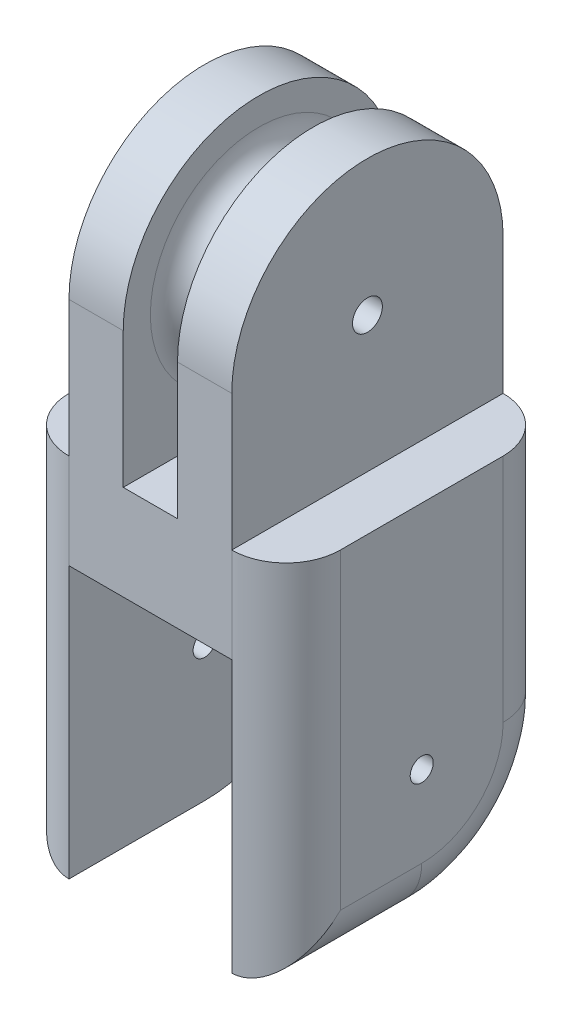
ISO-10303-21;
HEADER;
FILE_DESCRIPTION(('STEP AP214'),'2;1');
FILE_NAME('part.step','',(''),(''),'','','');
FILE_SCHEMA(('AUTOMOTIVE_DESIGN { 1 0 10303 214 1 1 1 1 }'));
ENDSEC;
DATA;
#1=APPLICATION_CONTEXT('core data for automotive mechanical design processes');
#2=APPLICATION_PROTOCOL_DEFINITION('international standard','automotive_design',2000,#1);
#3=PRODUCT_CONTEXT('',#1,'mechanical');
#4=PRODUCT('Part','Part','',(#3));
#5=PRODUCT_RELATED_PRODUCT_CATEGORY('part','',(#4));
#6=PRODUCT_DEFINITION_FORMATION('','',#4);
#7=PRODUCT_DEFINITION_CONTEXT('part definition',#1,'design');
#8=PRODUCT_DEFINITION('design','',#6,#7);
#9=PRODUCT_DEFINITION_SHAPE('','',#8);
#10=(LENGTH_UNIT() NAMED_UNIT(*) SI_UNIT(.MILLI.,.METRE.));
#11=(NAMED_UNIT(*) PLANE_ANGLE_UNIT() SI_UNIT($,.RADIAN.));
#12=(NAMED_UNIT(*) SI_UNIT($,.STERADIAN.) SOLID_ANGLE_UNIT());
#13=UNCERTAINTY_MEASURE_WITH_UNIT(LENGTH_MEASURE(1.E-05),#10,'distance_accuracy_value','');
#14=(GEOMETRIC_REPRESENTATION_CONTEXT(3) GLOBAL_UNCERTAINTY_ASSIGNED_CONTEXT((#13)) GLOBAL_UNIT_ASSIGNED_CONTEXT((#10,
#11,#12)) REPRESENTATION_CONTEXT('',''));
#15=CARTESIAN_POINT('',(0.,0.,0.));
#16=DIRECTION('',(0.,0.,1.));
#17=DIRECTION('',(1.,0.,0.));
#18=AXIS2_PLACEMENT_3D('',#15,#16,#17);
#19=CARTESIAN_POINT('',(0.,7.,0.));
#20=DIRECTION('',(0.,1.,0.));
#21=DIRECTION('',(0.,0.,1.));
#22=AXIS2_PLACEMENT_3D('',#19,#20,#21);
#23=PLANE('',#22);
#24=CARTESIAN_POINT('',(-6.,7.,6.));
#25=DIRECTION('',(0.,1.,0.));
#26=DIRECTION('',(0.,0.,1.));
#27=AXIS2_PLACEMENT_3D('',#24,#25,#26);
#28=CIRCLE('',#27,4.);
#29=CARTESIAN_POINT('',(-10.,7.,6.));
#30=VERTEX_POINT('',#29);
#31=CARTESIAN_POINT('',(-6.,7.,10.));
#32=VERTEX_POINT('',#31);
#33=EDGE_CURVE('E316',#30,#32,#28,.T.);
#34=ORIENTED_EDGE('',*,*,#33,.T.);
#35=DIRECTION('',(0.,0.,1.));
#36=VECTOR('',#35,1.);
#37=CARTESIAN_POINT('',(-6.,7.,10.));
#38=LINE('',#37,#36);
#39=CARTESIAN_POINT('',(-6.,7.,-10.));
#40=VERTEX_POINT('',#39);
#41=EDGE_CURVE('E169',#40,#32,#38,.T.);
#42=ORIENTED_EDGE('',*,*,#41,.F.);
#43=CARTESIAN_POINT('',(-6.,7.,-6.));
#44=DIRECTION('',(0.,1.,0.));
#45=DIRECTION('',(0.,0.,1.));
#46=AXIS2_PLACEMENT_3D('',#43,#44,#45);
#47=CIRCLE('',#46,4.);
#48=CARTESIAN_POINT('',(-10.,7.,-6.));
#49=VERTEX_POINT('',#48);
#50=EDGE_CURVE('E314',#40,#49,#47,.T.);
#51=ORIENTED_EDGE('',*,*,#50,.T.);
#52=DIRECTION('',(0.,0.,1.));
#53=VECTOR('',#52,1.);
#54=CARTESIAN_POINT('',(-10.,7.,-10.));
#55=LINE('',#54,#53);
#56=EDGE_CURVE('E273',#49,#30,#55,.T.);
#57=ORIENTED_EDGE('',*,*,#56,.T.);
#58=EDGE_LOOP('',(#34,#42,#51,#57));
#59=FACE_BOUND('',#58,.T.);
#60=ADVANCED_FACE('F37',(#59),#23,.T.);
#61=CARTESIAN_POINT('',(0.,7.,-6.));
#62=DIRECTION('',(0.,1.,0.));
#63=DIRECTION('',(0.,0.,1.));
#64=AXIS2_PLACEMENT_3D('',#61,#62,#63);
#65=CIRCLE('',#64,0.5);
#66=CARTESIAN_POINT('',(0.,7.,-5.5));
#67=VERTEX_POINT('',#66);
#68=EDGE_CURVE('E356',#67,#67,#65,.F.);
#69=ORIENTED_EDGE('',*,*,#68,.T.);
#70=EDGE_LOOP('',(#69));
#71=FACE_BOUND('',#70,.T.);
#72=CARTESIAN_POINT('',(0.,7.,6.));
#73=DIRECTION('',(0.,1.,0.));
#74=DIRECTION('',(0.,0.,1.));
#75=AXIS2_PLACEMENT_3D('',#72,#73,#74);
#76=CIRCLE('',#75,0.5);
#77=CARTESIAN_POINT('',(0.,7.,6.5));
#78=VERTEX_POINT('',#77);
#79=EDGE_CURVE('E364',#78,#78,#76,.F.);
#80=ORIENTED_EDGE('',*,*,#79,.T.);
#81=EDGE_LOOP('',(#80));
#82=FACE_BOUND('',#81,.T.);
#83=DIRECTION('',(-1.,0.,0.));
#84=VECTOR('',#83,1.);
#85=CARTESIAN_POINT('',(-10.,7.,-10.));
#86=LINE('',#85,#84);
#87=CARTESIAN_POINT('',(2.,7.,-10.));
#88=VERTEX_POINT('',#87);
#89=CARTESIAN_POINT('',(-2.,7.,-10.));
#90=VERTEX_POINT('',#89);
#91=EDGE_CURVE('E282',#88,#90,#86,.T.);
#92=ORIENTED_EDGE('',*,*,#91,.T.);
#93=DIRECTION('',(0.,0.,-1.));
#94=VECTOR('',#93,1.);
#95=CARTESIAN_POINT('',(-2.,7.,10.));
#96=LINE('',#95,#94);
#97=CARTESIAN_POINT('',(-2.,7.,10.));
#98=VERTEX_POINT('',#97);
#99=EDGE_CURVE('E53',#98,#90,#96,.T.);
#100=ORIENTED_EDGE('',*,*,#99,.F.);
#101=DIRECTION('',(1.,0.,0.));
#102=VECTOR('',#101,1.);
#103=CARTESIAN_POINT('',(-10.,7.,10.));
#104=LINE('',#103,#102);
#105=CARTESIAN_POINT('',(2.,7.,10.));
#106=VERTEX_POINT('',#105);
#107=EDGE_CURVE('E276',#98,#106,#104,.T.);
#108=ORIENTED_EDGE('',*,*,#107,.T.);
#109=DIRECTION('',(0.,0.,1.));
#110=VECTOR('',#109,1.);
#111=CARTESIAN_POINT('',(2.,7.,10.));
#112=LINE('',#111,#110);
#113=EDGE_CURVE('E214',#88,#106,#112,.T.);
#114=ORIENTED_EDGE('',*,*,#113,.F.);
#115=EDGE_LOOP('',(#92,#100,#108,#114));
#116=FACE_BOUND('',#115,.T.);
#117=ADVANCED_FACE('F439',(#71,#82,#116),#23,.T.);
#118=DIRECTION('',(0.,0.,-1.));
#119=VECTOR('',#118,1.);
#120=CARTESIAN_POINT('',(6.,7.,10.));
#121=LINE('',#120,#119);
#122=CARTESIAN_POINT('',(6.,7.,10.));
#123=VERTEX_POINT('',#122);
#124=CARTESIAN_POINT('',(6.,7.,-10.));
#125=VERTEX_POINT('',#124);
#126=EDGE_CURVE('E172',#123,#125,#121,.T.);
#127=ORIENTED_EDGE('',*,*,#126,.F.);
#128=CARTESIAN_POINT('',(6.,7.,6.));
#129=DIRECTION('',(0.,1.,0.));
#130=DIRECTION('',(0.,0.,1.));
#131=AXIS2_PLACEMENT_3D('',#128,#129,#130);
#132=CIRCLE('',#131,4.);
#133=CARTESIAN_POINT('',(10.,7.,6.));
#134=VERTEX_POINT('',#133);
#135=EDGE_CURVE('E318',#123,#134,#132,.T.);
#136=ORIENTED_EDGE('',*,*,#135,.T.);
#137=DIRECTION('',(0.,0.,-1.));
#138=VECTOR('',#137,1.);
#139=CARTESIAN_POINT('',(10.,7.,-10.));
#140=LINE('',#139,#138);
#141=CARTESIAN_POINT('',(10.,7.,-6.));
#142=VERTEX_POINT('',#141);
#143=EDGE_CURVE('E279',#134,#142,#140,.T.);
#144=ORIENTED_EDGE('',*,*,#143,.T.);
#145=CARTESIAN_POINT('',(6.,7.,-6.));
#146=DIRECTION('',(0.,1.,0.));
#147=DIRECTION('',(0.,0.,1.));
#148=AXIS2_PLACEMENT_3D('',#145,#146,#147);
#149=CIRCLE('',#148,4.);
#150=EDGE_CURVE('E311',#142,#125,#149,.T.);
#151=ORIENTED_EDGE('',*,*,#150,.T.);
#152=EDGE_LOOP('',(#127,#136,#144,#151));
#153=FACE_BOUND('',#152,.T.);
#154=ADVANCED_FACE('F375',(#153),#23,.T.);
#155=CARTESIAN_POINT('',(0.,0.,0.));
#156=DIRECTION('',(0.,1.,0.));
#157=DIRECTION('',(0.,0.,1.));
#158=AXIS2_PLACEMENT_3D('',#155,#156,#157);
#159=PLANE('',#158);
#160=CARTESIAN_POINT('',(0.,0.,-6.));
#161=DIRECTION('',(0.,-1.,0.));
#162=DIRECTION('',(0.,0.,-1.));
#163=AXIS2_PLACEMENT_3D('',#160,#161,#162);
#164=CIRCLE('',#163,0.5);
#165=CARTESIAN_POINT('',(0.,0.,-6.5));
#166=VERTEX_POINT('',#165);
#167=EDGE_CURVE('E352',#166,#166,#164,.T.);
#168=ORIENTED_EDGE('',*,*,#167,.F.);
#169=EDGE_LOOP('',(#168));
#170=FACE_BOUND('',#169,.T.);
#171=CARTESIAN_POINT('',(0.,0.,6.));
#172=DIRECTION('',(0.,-1.,0.));
#173=DIRECTION('',(0.,0.,1.));
#174=AXIS2_PLACEMENT_3D('',#171,#172,#173);
#175=CIRCLE('',#174,0.5);
#176=CARTESIAN_POINT('',(0.,0.,6.5));
#177=VERTEX_POINT('',#176);
#178=EDGE_CURVE('E361',#177,#177,#175,.T.);
#179=ORIENTED_EDGE('',*,*,#178,.F.);
#180=EDGE_LOOP('',(#179));
#181=FACE_BOUND('',#180,.T.);
#182=DIRECTION('',(0.,0.,-1.));
#183=VECTOR('',#182,1.);
#184=CARTESIAN_POINT('',(6.,0.,-10.));
#185=LINE('',#184,#183);
#186=CARTESIAN_POINT('',(6.,0.,10.));
#187=VERTEX_POINT('',#186);
#188=CARTESIAN_POINT('',(6.,0.,-10.));
#189=VERTEX_POINT('',#188);
#190=EDGE_CURVE('E255',#187,#189,#185,.T.);
#191=ORIENTED_EDGE('',*,*,#190,.F.);
#192=DIRECTION('',(1.,0.,0.));
#193=VECTOR('',#192,1.);
#194=CARTESIAN_POINT('',(-10.,0.,10.));
#195=LINE('',#194,#193);
#196=CARTESIAN_POINT('',(-6.,0.,10.));
#197=VERTEX_POINT('',#196);
#198=EDGE_CURVE('E272',#197,#187,#195,.T.);
#199=ORIENTED_EDGE('',*,*,#198,.F.);
#200=DIRECTION('',(0.,0.,1.));
#201=VECTOR('',#200,1.);
#202=CARTESIAN_POINT('',(-6.,0.,10.));
#203=LINE('',#202,#201);
#204=CARTESIAN_POINT('',(-6.,0.,-10.));
#205=VERTEX_POINT('',#204);
#206=EDGE_CURVE('E263',#205,#197,#203,.T.);
#207=ORIENTED_EDGE('',*,*,#206,.F.);
#208=DIRECTION('',(-1.,0.,0.));
#209=VECTOR('',#208,1.);
#210=CARTESIAN_POINT('',(-10.,0.,-10.));
#211=LINE('',#210,#209);
#212=EDGE_CURVE('E277',#189,#205,#211,.T.);
#213=ORIENTED_EDGE('',*,*,#212,.F.);
#214=EDGE_LOOP('',(#191,#199,#207,#213));
#215=FACE_BOUND('',#214,.T.);
#216=ADVANCED_FACE('F371',(#170,#181,#215),#159,.F.);
#217=CARTESIAN_POINT('',(-10.,7.,-10.));
#218=DIRECTION('',(1.,0.,0.));
#219=DIRECTION('',(0.,0.,-1.));
#220=AXIS2_PLACEMENT_3D('',#217,#218,#219);
#221=PLANE('',#220);
#222=CARTESIAN_POINT('',(-10.,-10.,0.));
#223=DIRECTION('',(-1.,0.,0.));
#224=DIRECTION('',(0.,0.,1.));
#225=AXIS2_PLACEMENT_3D('',#222,#223,#224);
#226=CIRCLE('',#225,0.85);
#227=CARTESIAN_POINT('',(-10.,-10.,0.850000000000001));
#228=VERTEX_POINT('',#227);
#229=EDGE_CURVE('E236',#228,#228,#226,.T.);
#230=ORIENTED_EDGE('',*,*,#229,.F.);
#231=EDGE_LOOP('',(#230));
#232=FACE_BOUND('',#231,.T.);
#233=DIRECTION('',(0.,0.,1.));
#234=VECTOR('',#233,1.);
#235=CARTESIAN_POINT('',(-10.,-16.,10.));
#236=LINE('',#235,#234);
#237=CARTESIAN_POINT('',(-10.,-16.,0.));
#238=VERTEX_POINT('',#237);
#239=CARTESIAN_POINT('',(-10.,-16.,6.));
#240=VERTEX_POINT('',#239);
#241=EDGE_CURVE('E292',#238,#240,#236,.T.);
#242=ORIENTED_EDGE('',*,*,#241,.T.);
#243=DIRECTION('',(0.,-1.,0.));
#244=VECTOR('',#243,1.);
#245=CARTESIAN_POINT('',(-10.,7.,6.));
#246=LINE('',#245,#244);
#247=EDGE_CURVE('E295',#240,#30,#246,.F.);
#248=ORIENTED_EDGE('',*,*,#247,.T.);
#249=ORIENTED_EDGE('',*,*,#56,.F.);
#250=DIRECTION('',(0.,-1.,0.));
#251=VECTOR('',#250,1.);
#252=CARTESIAN_POINT('',(-10.,7.,-6.));
#253=LINE('',#252,#251);
#254=CARTESIAN_POINT('',(-10.,-10.,-6.));
#255=VERTEX_POINT('',#254);
#256=EDGE_CURVE('E284',#49,#255,#253,.T.);
#257=ORIENTED_EDGE('',*,*,#256,.T.);
#258=CARTESIAN_POINT('',(-10.,-10.,0.));
#259=DIRECTION('',(1.,0.,0.));
#260=DIRECTION('',(0.,0.,-1.));
#261=AXIS2_PLACEMENT_3D('',#258,#259,#260);
#262=CIRCLE('',#261,6.);
#263=EDGE_CURVE('E290',#255,#238,#262,.F.);
#264=ORIENTED_EDGE('',*,*,#263,.T.);
#265=EDGE_LOOP('',(#242,#248,#249,#257,#264));
#266=FACE_BOUND('',#265,.T.);
#267=ADVANCED_FACE('F374',(#232,#266),#221,.F.);
#268=CARTESIAN_POINT('',(-10.,7.,10.));
#269=DIRECTION('',(0.,0.,-1.));
#270=DIRECTION('',(-1.,0.,0.));
#271=AXIS2_PLACEMENT_3D('',#268,#269,#270);
#272=PLANE('',#271);
#273=ORIENTED_EDGE('',*,*,#198,.T.);
#274=DIRECTION('',(0.,-1.,0.));
#275=VECTOR('',#274,1.);
#276=CARTESIAN_POINT('',(6.,7.,10.));
#277=LINE('',#276,#275);
#278=EDGE_CURVE('E308',#187,#123,#277,.F.);
#279=ORIENTED_EDGE('',*,*,#278,.T.);
#280=DIRECTION('',(0.,-1.,0.));
#281=VECTOR('',#280,1.);
#282=CARTESIAN_POINT('',(6.,17.,10.));
#283=LINE('',#282,#281);
#284=CARTESIAN_POINT('',(6.,17.,10.));
#285=VERTEX_POINT('',#284);
#286=EDGE_CURVE('E217',#285,#123,#283,.T.);
#287=ORIENTED_EDGE('',*,*,#286,.F.);
#288=DIRECTION('',(1.,0.,0.));
#289=VECTOR('',#288,1.);
#290=CARTESIAN_POINT('',(6.,17.,10.));
#291=LINE('',#290,#289);
#292=CARTESIAN_POINT('',(2.,17.,10.));
#293=VERTEX_POINT('',#292);
#294=EDGE_CURVE('E213',#293,#285,#291,.T.);
#295=ORIENTED_EDGE('',*,*,#294,.F.);
#296=DIRECTION('',(0.,-1.,0.));
#297=VECTOR('',#296,1.);
#298=CARTESIAN_POINT('',(2.,17.,10.));
#299=LINE('',#298,#297);
#300=EDGE_CURVE('E222',#293,#106,#299,.T.);
#301=ORIENTED_EDGE('',*,*,#300,.T.);
#302=ORIENTED_EDGE('',*,*,#107,.F.);
#303=DIRECTION('',(0.,-1.,0.));
#304=VECTOR('',#303,1.);
#305=CARTESIAN_POINT('',(-2.,17.,10.));
#306=LINE('',#305,#304);
#307=CARTESIAN_POINT('',(-2.,17.,10.));
#308=VERTEX_POINT('',#307);
#309=EDGE_CURVE('E173',#308,#98,#306,.T.);
#310=ORIENTED_EDGE('',*,*,#309,.F.);
#311=DIRECTION('',(1.,0.,0.));
#312=VECTOR('',#311,1.);
#313=CARTESIAN_POINT('',(-6.,17.,10.));
#314=LINE('',#313,#312);
#315=CARTESIAN_POINT('',(-6.,17.,10.));
#316=VERTEX_POINT('',#315);
#317=EDGE_CURVE('E176',#316,#308,#314,.T.);
#318=ORIENTED_EDGE('',*,*,#317,.F.);
#319=DIRECTION('',(0.,-1.,0.));
#320=VECTOR('',#319,1.);
#321=CARTESIAN_POINT('',(-6.,17.,10.));
#322=LINE('',#321,#320);
#323=EDGE_CURVE('E162',#316,#32,#322,.T.);
#324=ORIENTED_EDGE('',*,*,#323,.T.);
#325=DIRECTION('',(0.,-1.,0.));
#326=VECTOR('',#325,1.);
#327=CARTESIAN_POINT('',(-6.,7.,10.));
#328=LINE('',#327,#326);
#329=EDGE_CURVE('E306',#32,#197,#328,.T.);
#330=ORIENTED_EDGE('',*,*,#329,.T.);
#331=EDGE_LOOP('',(#273,#279,#287,#295,#301,#302,#310,#318,#324,#330));
#332=FACE_BOUND('',#331,.T.);
#333=ADVANCED_FACE('F178',(#332),#272,.F.);
#334=CARTESIAN_POINT('',(10.,7.,-10.));
#335=DIRECTION('',(-1.,0.,0.));
#336=DIRECTION('',(0.,0.,1.));
#337=AXIS2_PLACEMENT_3D('',#334,#335,#336);
#338=PLANE('',#337);
#339=CARTESIAN_POINT('',(10.,-10.,0.));
#340=DIRECTION('',(-1.,0.,0.));
#341=DIRECTION('',(0.,0.,1.));
#342=AXIS2_PLACEMENT_3D('',#339,#340,#341);
#343=CIRCLE('',#342,0.85);
#344=CARTESIAN_POINT('',(10.,-10.,0.849999999999999));
#345=VERTEX_POINT('',#344);
#346=EDGE_CURVE('E232',#345,#345,#343,.T.);
#347=ORIENTED_EDGE('',*,*,#346,.T.);
#348=EDGE_LOOP('',(#347));
#349=FACE_BOUND('',#348,.T.);
#350=ORIENTED_EDGE('',*,*,#143,.F.);
#351=DIRECTION('',(0.,-1.,0.));
#352=VECTOR('',#351,1.);
#353=CARTESIAN_POINT('',(10.,7.,6.));
#354=LINE('',#353,#352);
#355=CARTESIAN_POINT('',(10.,-16.,6.));
#356=VERTEX_POINT('',#355);
#357=EDGE_CURVE('E304',#134,#356,#354,.T.);
#358=ORIENTED_EDGE('',*,*,#357,.T.);
#359=DIRECTION('',(0.,0.,-1.));
#360=VECTOR('',#359,1.);
#361=CARTESIAN_POINT('',(10.,-16.,0.));
#362=LINE('',#361,#360);
#363=CARTESIAN_POINT('',(10.,-16.,0.));
#364=VERTEX_POINT('',#363);
#365=EDGE_CURVE('E301',#356,#364,#362,.T.);
#366=ORIENTED_EDGE('',*,*,#365,.T.);
#367=CARTESIAN_POINT('',(10.,-10.,0.));
#368=DIRECTION('',(-1.,0.,0.));
#369=DIRECTION('',(0.,0.,1.));
#370=AXIS2_PLACEMENT_3D('',#367,#368,#369);
#371=CIRCLE('',#370,6.);
#372=CARTESIAN_POINT('',(10.,-10.,-6.));
#373=VERTEX_POINT('',#372);
#374=EDGE_CURVE('E299',#364,#373,#371,.F.);
#375=ORIENTED_EDGE('',*,*,#374,.T.);
#376=DIRECTION('',(0.,-1.,0.));
#377=VECTOR('',#376,1.);
#378=CARTESIAN_POINT('',(10.,7.,-6.));
#379=LINE('',#378,#377);
#380=EDGE_CURVE('E297',#373,#142,#379,.F.);
#381=ORIENTED_EDGE('',*,*,#380,.T.);
#382=EDGE_LOOP('',(#350,#358,#366,#375,#381));
#383=FACE_BOUND('',#382,.T.);
#384=ADVANCED_FACE('F434',(#349,#383),#338,.F.);
#385=CARTESIAN_POINT('',(-10.,7.,-10.));
#386=DIRECTION('',(0.,0.,1.));
#387=DIRECTION('',(1.,0.,0.));
#388=AXIS2_PLACEMENT_3D('',#385,#386,#387);
#389=PLANE('',#388);
#390=ORIENTED_EDGE('',*,*,#212,.T.);
#391=DIRECTION('',(0.,-1.,0.));
#392=VECTOR('',#391,1.);
#393=CARTESIAN_POINT('',(-6.,7.,-10.));
#394=LINE('',#393,#392);
#395=EDGE_CURVE('E322',#205,#40,#394,.F.);
#396=ORIENTED_EDGE('',*,*,#395,.T.);
#397=DIRECTION('',(0.,-1.,0.));
#398=VECTOR('',#397,1.);
#399=CARTESIAN_POINT('',(-6.,17.,-10.));
#400=LINE('',#399,#398);
#401=CARTESIAN_POINT('',(-6.,17.,-10.));
#402=VERTEX_POINT('',#401);
#403=EDGE_CURVE('E202',#402,#40,#400,.T.);
#404=ORIENTED_EDGE('',*,*,#403,.F.);
#405=DIRECTION('',(-1.,0.,0.));
#406=VECTOR('',#405,1.);
#407=CARTESIAN_POINT('',(-6.,17.,-10.));
#408=LINE('',#407,#406);
#409=CARTESIAN_POINT('',(-2.,17.,-10.));
#410=VERTEX_POINT('',#409);
#411=EDGE_CURVE('E182',#410,#402,#408,.T.);
#412=ORIENTED_EDGE('',*,*,#411,.F.);
#413=DIRECTION('',(0.,-1.,0.));
#414=VECTOR('',#413,1.);
#415=CARTESIAN_POINT('',(-2.,17.,-10.));
#416=LINE('',#415,#414);
#417=EDGE_CURVE('E206',#410,#90,#416,.T.);
#418=ORIENTED_EDGE('',*,*,#417,.T.);
#419=ORIENTED_EDGE('',*,*,#91,.F.);
#420=DIRECTION('',(0.,-1.,0.));
#421=VECTOR('',#420,1.);
#422=CARTESIAN_POINT('',(2.,17.,-10.));
#423=LINE('',#422,#421);
#424=CARTESIAN_POINT('',(2.,17.,-10.));
#425=VERTEX_POINT('',#424);
#426=EDGE_CURVE('E225',#425,#88,#423,.T.);
#427=ORIENTED_EDGE('',*,*,#426,.F.);
#428=DIRECTION('',(-1.,0.,0.));
#429=VECTOR('',#428,1.);
#430=CARTESIAN_POINT('',(6.,17.,-10.));
#431=LINE('',#430,#429);
#432=CARTESIAN_POINT('',(6.,17.,-10.));
#433=VERTEX_POINT('',#432);
#434=EDGE_CURVE('E210',#433,#425,#431,.T.);
#435=ORIENTED_EDGE('',*,*,#434,.F.);
#436=DIRECTION('',(0.,-1.,0.));
#437=VECTOR('',#436,1.);
#438=CARTESIAN_POINT('',(6.,17.,-10.));
#439=LINE('',#438,#437);
#440=EDGE_CURVE('E228',#433,#125,#439,.T.);
#441=ORIENTED_EDGE('',*,*,#440,.T.);
#442=DIRECTION('',(0.,-1.,0.));
#443=VECTOR('',#442,1.);
#444=CARTESIAN_POINT('',(6.,7.,-10.));
#445=LINE('',#444,#443);
#446=EDGE_CURVE('E320',#125,#189,#445,.T.);
#447=ORIENTED_EDGE('',*,*,#446,.T.);
#448=EDGE_LOOP('',(#390,#396,#404,#412,#418,#419,#427,#435,#441,#447));
#449=FACE_BOUND('',#448,.T.);
#450=ADVANCED_FACE('F404',(#449),#389,.F.);
#451=CARTESIAN_POINT('',(-6.,-10.,10.));
#452=DIRECTION('',(-1.,0.,0.));
#453=DIRECTION('',(0.,0.,1.));
#454=AXIS2_PLACEMENT_3D('',#451,#452,#453);
#455=PLANE('',#454);
#456=CARTESIAN_POINT('',(-6.,-10.,0.));
#457=DIRECTION('',(-1.,0.,0.));
#458=DIRECTION('',(0.,0.,1.));
#459=AXIS2_PLACEMENT_3D('',#456,#457,#458);
#460=CIRCLE('',#459,0.85);
#461=CARTESIAN_POINT('',(-6.,-10.,0.850000000000001));
#462=VERTEX_POINT('',#461);
#463=EDGE_CURVE('E240',#462,#462,#460,.T.);
#464=ORIENTED_EDGE('',*,*,#463,.T.);
#465=EDGE_LOOP('',(#464));
#466=FACE_BOUND('',#465,.T.);
#467=ORIENTED_EDGE('',*,*,#206,.T.);
#468=DIRECTION('',(0.,1.,0.));
#469=VECTOR('',#468,1.);
#470=CARTESIAN_POINT('',(-6.,-10.,10.));
#471=LINE('',#470,#469);
#472=CARTESIAN_POINT('',(-6.,-20.,10.));
#473=VERTEX_POINT('',#472);
#474=EDGE_CURVE('E266',#473,#197,#471,.T.);
#475=ORIENTED_EDGE('',*,*,#474,.F.);
#476=DIRECTION('',(0.,0.,1.));
#477=VECTOR('',#476,1.);
#478=CARTESIAN_POINT('',(-6.,-20.,0.));
#479=LINE('',#478,#477);
#480=CARTESIAN_POINT('',(-6.,-20.,0.));
#481=VERTEX_POINT('',#480);
#482=EDGE_CURVE('E252',#481,#473,#479,.T.);
#483=ORIENTED_EDGE('',*,*,#482,.F.);
#484=CARTESIAN_POINT('',(-6.,-10.,0.));
#485=DIRECTION('',(-1.,0.,0.));
#486=DIRECTION('',(0.,0.,1.));
#487=AXIS2_PLACEMENT_3D('',#484,#485,#486);
#488=CIRCLE('',#487,10.);
#489=CARTESIAN_POINT('',(-6.,-10.,-10.));
#490=VERTEX_POINT('',#489);
#491=EDGE_CURVE('E249',#490,#481,#488,.T.);
#492=ORIENTED_EDGE('',*,*,#491,.F.);
#493=DIRECTION('',(0.,1.,0.));
#494=VECTOR('',#493,1.);
#495=CARTESIAN_POINT('',(-6.,-10.,-10.));
#496=LINE('',#495,#494);
#497=EDGE_CURVE('E269',#490,#205,#496,.T.);
#498=ORIENTED_EDGE('',*,*,#497,.T.);
#499=EDGE_LOOP('',(#467,#475,#483,#492,#498));
#500=FACE_BOUND('',#499,.T.);
#501=ADVANCED_FACE('F416',(#466,#500),#455,.F.);
#502=CARTESIAN_POINT('',(6.,-10.,-10.));
#503=DIRECTION('',(1.,0.,0.));
#504=DIRECTION('',(0.,0.,-1.));
#505=AXIS2_PLACEMENT_3D('',#502,#503,#504);
#506=PLANE('',#505);
#507=CARTESIAN_POINT('',(6.,-10.,0.));
#508=DIRECTION('',(1.,0.,0.));
#509=DIRECTION('',(0.,0.,-1.));
#510=AXIS2_PLACEMENT_3D('',#507,#508,#509);
#511=CIRCLE('',#510,0.85);
#512=CARTESIAN_POINT('',(6.,-10.,-0.850000000000001));
#513=VERTEX_POINT('',#512);
#514=EDGE_CURVE('E235',#513,#513,#511,.T.);
#515=ORIENTED_EDGE('',*,*,#514,.T.);
#516=EDGE_LOOP('',(#515));
#517=FACE_BOUND('',#516,.T.);
#518=ORIENTED_EDGE('',*,*,#190,.T.);
#519=DIRECTION('',(0.,1.,0.));
#520=VECTOR('',#519,1.);
#521=CARTESIAN_POINT('',(6.,-10.,-10.));
#522=LINE('',#521,#520);
#523=CARTESIAN_POINT('',(6.,-10.,-10.));
#524=VERTEX_POINT('',#523);
#525=EDGE_CURVE('E258',#524,#189,#522,.T.);
#526=ORIENTED_EDGE('',*,*,#525,.F.);
#527=CARTESIAN_POINT('',(6.,-10.,0.));
#528=DIRECTION('',(1.,0.,0.));
#529=DIRECTION('',(0.,0.,-1.));
#530=AXIS2_PLACEMENT_3D('',#527,#528,#529);
#531=CIRCLE('',#530,10.);
#532=CARTESIAN_POINT('',(6.,-20.,0.));
#533=VERTEX_POINT('',#532);
#534=EDGE_CURVE('E246',#533,#524,#531,.T.);
#535=ORIENTED_EDGE('',*,*,#534,.F.);
#536=DIRECTION('',(0.,0.,-1.));
#537=VECTOR('',#536,1.);
#538=CARTESIAN_POINT('',(6.,-20.,0.));
#539=LINE('',#538,#537);
#540=CARTESIAN_POINT('',(6.,-20.,9.99999999999999));
#541=VERTEX_POINT('',#540);
#542=EDGE_CURVE('E243',#541,#533,#539,.T.);
#543=ORIENTED_EDGE('',*,*,#542,.F.);
#544=DIRECTION('',(0.,1.,0.));
#545=VECTOR('',#544,1.);
#546=CARTESIAN_POINT('',(6.,-10.,10.));
#547=LINE('',#546,#545);
#548=EDGE_CURVE('E261',#541,#187,#547,.T.);
#549=ORIENTED_EDGE('',*,*,#548,.T.);
#550=EDGE_LOOP('',(#518,#526,#535,#543,#549));
#551=FACE_BOUND('',#550,.T.);
#552=ADVANCED_FACE('F455',(#517,#551),#506,.F.);
#553=CARTESIAN_POINT('',(10.,-10.,0.));
#554=DIRECTION('',(-1.,0.,0.));
#555=DIRECTION('',(0.,0.,1.));
#556=AXIS2_PLACEMENT_3D('',#553,#554,#555);
#557=CYLINDRICAL_SURFACE('',#556,0.85);
#558=ORIENTED_EDGE('',*,*,#346,.F.);
#559=EDGE_LOOP('',(#558));
#560=FACE_BOUND('',#559,.T.);
#561=ORIENTED_EDGE('',*,*,#514,.F.);
#562=EDGE_LOOP('',(#561));
#563=FACE_BOUND('',#562,.T.);
#564=ADVANCED_FACE('F473',(#560,#563),#557,.F.);
#565=ORIENTED_EDGE('',*,*,#229,.T.);
#566=EDGE_LOOP('',(#565));
#567=FACE_BOUND('',#566,.T.);
#568=ORIENTED_EDGE('',*,*,#463,.F.);
#569=EDGE_LOOP('',(#568));
#570=FACE_BOUND('',#569,.T.);
#571=ADVANCED_FACE('F476',(#567,#570),#557,.F.);
#572=CARTESIAN_POINT('',(-6.,7.,-6.));
#573=DIRECTION('',(0.,-1.,0.));
#574=DIRECTION('',(0.,0.,-1.));
#575=AXIS2_PLACEMENT_3D('',#572,#573,#574);
#576=CYLINDRICAL_SURFACE('',#575,4.);
#577=ORIENTED_EDGE('',*,*,#395,.F.);
#578=ORIENTED_EDGE('',*,*,#497,.F.);
#579=CARTESIAN_POINT('',(-6.,-10.,-6.));
#580=DIRECTION('',(0.,-1.,0.));
#581=DIRECTION('',(0.,0.,-1.));
#582=AXIS2_PLACEMENT_3D('',#579,#580,#581);
#583=CIRCLE('',#582,4.);
#584=EDGE_CURVE('E239',#255,#490,#583,.T.);
#585=ORIENTED_EDGE('',*,*,#584,.F.);
#586=ORIENTED_EDGE('',*,*,#256,.F.);
#587=ORIENTED_EDGE('',*,*,#50,.F.);
#588=EDGE_LOOP('',(#577,#578,#585,#586,#587));
#589=FACE_BOUND('',#588,.T.);
#590=ADVANCED_FACE('F425',(#589),#576,.T.);
#591=CARTESIAN_POINT('',(-6.,-10.,0.));
#592=DIRECTION('',(1.,0.,0.));
#593=DIRECTION('',(0.,0.,-1.));
#594=AXIS2_PLACEMENT_3D('',#591,#592,#593);
#595=TOROIDAL_SURFACE('',#594,6.,4.);
#596=ORIENTED_EDGE('',*,*,#584,.T.);
#597=ORIENTED_EDGE('',*,*,#491,.T.);
#598=CARTESIAN_POINT('',(-6.,-16.,0.));
#599=DIRECTION('',(0.,0.,1.));
#600=DIRECTION('',(1.,0.,0.));
#601=AXIS2_PLACEMENT_3D('',#598,#599,#600);
#602=CIRCLE('',#601,4.);
#603=EDGE_CURVE('E327',#238,#481,#602,.T.);
#604=ORIENTED_EDGE('',*,*,#603,.F.);
#605=ORIENTED_EDGE('',*,*,#263,.F.);
#606=EDGE_LOOP('',(#596,#597,#604,#605));
#607=FACE_BOUND('',#606,.T.);
#608=ADVANCED_FACE('F423',(#607),#595,.T.);
#609=CARTESIAN_POINT('',(-6.,7.,6.));
#610=DIRECTION('',(0.,-1.,0.));
#611=DIRECTION('',(0.,0.,-1.));
#612=AXIS2_PLACEMENT_3D('',#609,#610,#611);
#613=CYLINDRICAL_SURFACE('',#612,4.);
#614=ORIENTED_EDGE('',*,*,#33,.F.);
#615=ORIENTED_EDGE('',*,*,#247,.F.);
#616=CARTESIAN_POINT('',(-6.,-16.,6.));
#617=DIRECTION('',(0.,-0.707106781186547,-0.707106781186547));
#618=DIRECTION('',(0.,-0.707106781186547,0.707106781186547));
#619=AXIS2_PLACEMENT_3D('',#616,#617,#618);
#620=ELLIPSE('',#619,5.65685424949238,4.);
#621=EDGE_CURVE('E325',#473,#240,#620,.T.);
#622=ORIENTED_EDGE('',*,*,#621,.F.);
#623=ORIENTED_EDGE('',*,*,#474,.T.);
#624=ORIENTED_EDGE('',*,*,#329,.F.);
#625=EDGE_LOOP('',(#614,#615,#622,#623,#624));
#626=FACE_BOUND('',#625,.T.);
#627=ADVANCED_FACE('F413',(#626),#613,.T.);
#628=CARTESIAN_POINT('',(-6.,-16.,-10.));
#629=DIRECTION('',(0.,0.,-1.));
#630=DIRECTION('',(-1.,0.,0.));
#631=AXIS2_PLACEMENT_3D('',#628,#629,#630);
#632=CYLINDRICAL_SURFACE('',#631,4.);
#633=ORIENTED_EDGE('',*,*,#603,.T.);
#634=ORIENTED_EDGE('',*,*,#482,.T.);
#635=ORIENTED_EDGE('',*,*,#621,.T.);
#636=ORIENTED_EDGE('',*,*,#241,.F.);
#637=EDGE_LOOP('',(#633,#634,#635,#636));
#638=FACE_BOUND('',#637,.T.);
#639=ADVANCED_FACE('F418',(#638),#632,.T.);
#640=CARTESIAN_POINT('',(6.,7.,-6.));
#641=DIRECTION('',(0.,-1.,0.));
#642=DIRECTION('',(0.,0.,-1.));
#643=AXIS2_PLACEMENT_3D('',#640,#641,#642);
#644=CYLINDRICAL_SURFACE('',#643,4.);
#645=ORIENTED_EDGE('',*,*,#150,.F.);
#646=ORIENTED_EDGE('',*,*,#380,.F.);
#647=CARTESIAN_POINT('',(6.,-10.,-6.));
#648=DIRECTION('',(0.,-1.,0.));
#649=DIRECTION('',(0.,0.,-1.));
#650=AXIS2_PLACEMENT_3D('',#647,#648,#649);
#651=CIRCLE('',#650,4.);
#652=EDGE_CURVE('E328',#524,#373,#651,.T.);
#653=ORIENTED_EDGE('',*,*,#652,.F.);
#654=ORIENTED_EDGE('',*,*,#525,.T.);
#655=ORIENTED_EDGE('',*,*,#446,.F.);
#656=EDGE_LOOP('',(#645,#646,#653,#654,#655));
#657=FACE_BOUND('',#656,.T.);
#658=ADVANCED_FACE('F453',(#657),#644,.T.);
#659=CARTESIAN_POINT('',(6.,7.,6.));
#660=DIRECTION('',(0.,-1.,0.));
#661=DIRECTION('',(0.,0.,-1.));
#662=AXIS2_PLACEMENT_3D('',#659,#660,#661);
#663=CYLINDRICAL_SURFACE('',#662,4.);
#664=ORIENTED_EDGE('',*,*,#278,.F.);
#665=ORIENTED_EDGE('',*,*,#548,.F.);
#666=CARTESIAN_POINT('',(6.,-16.,6.));
#667=DIRECTION('',(0.,-0.707106781186547,-0.707106781186547));
#668=DIRECTION('',(0.,-0.707106781186547,0.707106781186547));
#669=AXIS2_PLACEMENT_3D('',#666,#667,#668);
#670=ELLIPSE('',#669,5.65685424949238,4.);
#671=EDGE_CURVE('E334',#356,#541,#670,.T.);
#672=ORIENTED_EDGE('',*,*,#671,.F.);
#673=ORIENTED_EDGE('',*,*,#357,.F.);
#674=ORIENTED_EDGE('',*,*,#135,.F.);
#675=EDGE_LOOP('',(#664,#665,#672,#673,#674));
#676=FACE_BOUND('',#675,.T.);
#677=ADVANCED_FACE('F388',(#676),#663,.T.);
#678=CARTESIAN_POINT('',(6.,-10.,0.));
#679=DIRECTION('',(-1.,0.,0.));
#680=DIRECTION('',(0.,0.,1.));
#681=AXIS2_PLACEMENT_3D('',#678,#679,#680);
#682=TOROIDAL_SURFACE('',#681,6.,4.);
#683=ORIENTED_EDGE('',*,*,#652,.T.);
#684=ORIENTED_EDGE('',*,*,#374,.F.);
#685=CARTESIAN_POINT('',(6.,-16.,0.));
#686=DIRECTION('',(0.,0.,1.));
#687=DIRECTION('',(1.,0.,0.));
#688=AXIS2_PLACEMENT_3D('',#685,#686,#687);
#689=CIRCLE('',#688,4.);
#690=EDGE_CURVE('E231',#533,#364,#689,.T.);
#691=ORIENTED_EDGE('',*,*,#690,.F.);
#692=ORIENTED_EDGE('',*,*,#534,.T.);
#693=EDGE_LOOP('',(#683,#684,#691,#692));
#694=FACE_BOUND('',#693,.T.);
#695=ADVANCED_FACE('F462',(#694),#682,.T.);
#696=CARTESIAN_POINT('',(6.,-16.,-10.));
#697=DIRECTION('',(0.,0.,1.));
#698=DIRECTION('',(1.,0.,0.));
#699=AXIS2_PLACEMENT_3D('',#696,#697,#698);
#700=CYLINDRICAL_SURFACE('',#699,4.);
#701=ORIENTED_EDGE('',*,*,#671,.T.);
#702=ORIENTED_EDGE('',*,*,#542,.T.);
#703=ORIENTED_EDGE('',*,*,#690,.T.);
#704=ORIENTED_EDGE('',*,*,#365,.F.);
#705=EDGE_LOOP('',(#701,#702,#703,#704));
#706=FACE_BOUND('',#705,.T.);
#707=ADVANCED_FACE('F459',(#706),#700,.T.);
#708=CARTESIAN_POINT('',(6.,17.,10.));
#709=DIRECTION('',(-1.,0.,0.));
#710=DIRECTION('',(0.,0.,1.));
#711=AXIS2_PLACEMENT_3D('',#708,#709,#710);
#712=PLANE('',#711);
#713=CARTESIAN_POINT('',(6.,17.,0.));
#714=DIRECTION('',(-1.,0.,0.));
#715=DIRECTION('',(0.,0.,1.));
#716=AXIS2_PLACEMENT_3D('',#713,#714,#715);
#717=CIRCLE('',#716,1.1);
#718=CARTESIAN_POINT('',(6.,17.,1.1));
#719=VERTEX_POINT('',#718);
#720=EDGE_CURVE('E188',#719,#719,#717,.T.);
#721=ORIENTED_EDGE('',*,*,#720,.T.);
#722=EDGE_LOOP('',(#721));
#723=FACE_BOUND('',#722,.T.);
#724=ORIENTED_EDGE('',*,*,#126,.T.);
#725=ORIENTED_EDGE('',*,*,#440,.F.);
#726=CARTESIAN_POINT('',(6.,17.,0.));
#727=DIRECTION('',(1.,0.,0.));
#728=DIRECTION('',(0.,0.,-1.));
#729=AXIS2_PLACEMENT_3D('',#726,#727,#728);
#730=CIRCLE('',#729,10.);
#731=EDGE_CURVE('E190',#433,#285,#730,.T.);
#732=ORIENTED_EDGE('',*,*,#731,.T.);
#733=ORIENTED_EDGE('',*,*,#286,.T.);
#734=EDGE_LOOP('',(#724,#725,#732,#733));
#735=FACE_BOUND('',#734,.T.);
#736=ADVANCED_FACE('F394',(#723,#735),#712,.F.);
#737=CARTESIAN_POINT('',(2.,17.,10.));
#738=DIRECTION('',(1.,0.,0.));
#739=DIRECTION('',(0.,0.,-1.));
#740=AXIS2_PLACEMENT_3D('',#737,#738,#739);
#741=PLANE('',#740);
#742=CARTESIAN_POINT('',(2.,17.,0.));
#743=DIRECTION('',(1.,0.,0.));
#744=DIRECTION('',(0.,0.,-1.));
#745=AXIS2_PLACEMENT_3D('',#742,#743,#744);
#746=CIRCLE('',#745,8.);
#747=CARTESIAN_POINT('',(2.,17.,-8.));
#748=VERTEX_POINT('',#747);
#749=EDGE_CURVE('E46',#748,#748,#746,.T.);
#750=ORIENTED_EDGE('',*,*,#749,.T.);
#751=EDGE_LOOP('',(#750));
#752=FACE_BOUND('',#751,.T.);
#753=ORIENTED_EDGE('',*,*,#113,.T.);
#754=ORIENTED_EDGE('',*,*,#300,.F.);
#755=CARTESIAN_POINT('',(2.,17.,0.));
#756=DIRECTION('',(1.,0.,0.));
#757=DIRECTION('',(0.,0.,-1.));
#758=AXIS2_PLACEMENT_3D('',#755,#756,#757);
#759=CIRCLE('',#758,10.);
#760=EDGE_CURVE('E196',#425,#293,#759,.T.);
#761=ORIENTED_EDGE('',*,*,#760,.F.);
#762=ORIENTED_EDGE('',*,*,#426,.T.);
#763=EDGE_LOOP('',(#753,#754,#761,#762));
#764=FACE_BOUND('',#763,.T.);
#765=ADVANCED_FACE('F342',(#752,#764),#741,.F.);
#766=CARTESIAN_POINT('',(-6.,17.,10.));
#767=DIRECTION('',(1.,0.,0.));
#768=DIRECTION('',(0.,0.,-1.));
#769=AXIS2_PLACEMENT_3D('',#766,#767,#768);
#770=PLANE('',#769);
#771=CARTESIAN_POINT('',(-6.,17.,0.));
#772=DIRECTION('',(-1.,0.,0.));
#773=DIRECTION('',(0.,0.,1.));
#774=AXIS2_PLACEMENT_3D('',#771,#772,#773);
#775=CIRCLE('',#774,1.1);
#776=CARTESIAN_POINT('',(-6.,17.,1.1));
#777=VERTEX_POINT('',#776);
#778=EDGE_CURVE('E193',#777,#777,#775,.T.);
#779=ORIENTED_EDGE('',*,*,#778,.F.);
#780=EDGE_LOOP('',(#779));
#781=FACE_BOUND('',#780,.T.);
#782=ORIENTED_EDGE('',*,*,#41,.T.);
#783=ORIENTED_EDGE('',*,*,#323,.F.);
#784=CARTESIAN_POINT('',(-6.,17.,0.));
#785=DIRECTION('',(-1.,0.,0.));
#786=DIRECTION('',(0.,0.,1.));
#787=AXIS2_PLACEMENT_3D('',#784,#785,#786);
#788=CIRCLE('',#787,10.);
#789=EDGE_CURVE('E167',#316,#402,#788,.T.);
#790=ORIENTED_EDGE('',*,*,#789,.T.);
#791=ORIENTED_EDGE('',*,*,#403,.T.);
#792=EDGE_LOOP('',(#782,#783,#790,#791));
#793=FACE_BOUND('',#792,.T.);
#794=ADVANCED_FACE('F164',(#781,#793),#770,.F.);
#795=CARTESIAN_POINT('',(-2.,17.,10.));
#796=DIRECTION('',(-1.,0.,0.));
#797=DIRECTION('',(0.,0.,1.));
#798=AXIS2_PLACEMENT_3D('',#795,#796,#797);
#799=PLANE('',#798);
#800=CARTESIAN_POINT('',(-2.,17.,0.));
#801=DIRECTION('',(-1.,0.,0.));
#802=DIRECTION('',(0.,0.,1.));
#803=AXIS2_PLACEMENT_3D('',#800,#801,#802);
#804=CIRCLE('',#803,8.);
#805=CARTESIAN_POINT('',(-2.,17.,8.));
#806=VERTEX_POINT('',#805);
#807=EDGE_CURVE('E11',#806,#806,#804,.T.);
#808=ORIENTED_EDGE('',*,*,#807,.T.);
#809=EDGE_LOOP('',(#808));
#810=FACE_BOUND('',#809,.T.);
#811=ORIENTED_EDGE('',*,*,#99,.T.);
#812=ORIENTED_EDGE('',*,*,#417,.F.);
#813=CARTESIAN_POINT('',(-2.,17.,0.));
#814=DIRECTION('',(-1.,0.,0.));
#815=DIRECTION('',(0.,0.,1.));
#816=AXIS2_PLACEMENT_3D('',#813,#814,#815);
#817=CIRCLE('',#816,10.);
#818=EDGE_CURVE('E187',#308,#410,#817,.T.);
#819=ORIENTED_EDGE('',*,*,#818,.F.);
#820=ORIENTED_EDGE('',*,*,#309,.T.);
#821=EDGE_LOOP('',(#811,#812,#819,#820));
#822=FACE_BOUND('',#821,.T.);
#823=ADVANCED_FACE('F401',(#810,#822),#799,.F.);
#824=CARTESIAN_POINT('',(2.,17.,0.));
#825=DIRECTION('',(1.,0.,0.));
#826=DIRECTION('',(0.,0.,-1.));
#827=AXIS2_PLACEMENT_3D('',#824,#825,#826);
#828=CYLINDRICAL_SURFACE('',#827,10.);
#829=ORIENTED_EDGE('',*,*,#760,.T.);
#830=ORIENTED_EDGE('',*,*,#294,.T.);
#831=ORIENTED_EDGE('',*,*,#731,.F.);
#832=ORIENTED_EDGE('',*,*,#434,.T.);
#833=EDGE_LOOP('',(#829,#830,#831,#832));
#834=FACE_BOUND('',#833,.T.);
#835=ADVANCED_FACE('F398',(#834),#828,.T.);
#836=CARTESIAN_POINT('',(-2.,17.,0.));
#837=DIRECTION('',(-1.,0.,0.));
#838=DIRECTION('',(0.,0.,1.));
#839=AXIS2_PLACEMENT_3D('',#836,#837,#838);
#840=CYLINDRICAL_SURFACE('',#839,10.);
#841=ORIENTED_EDGE('',*,*,#317,.T.);
#842=ORIENTED_EDGE('',*,*,#818,.T.);
#843=ORIENTED_EDGE('',*,*,#411,.T.);
#844=ORIENTED_EDGE('',*,*,#789,.F.);
#845=EDGE_LOOP('',(#841,#842,#843,#844));
#846=FACE_BOUND('',#845,.T.);
#847=ADVANCED_FACE('F185',(#846),#840,.T.);
#848=CARTESIAN_POINT('',(10.,17.,0.));
#849=DIRECTION('',(-1.,0.,0.));
#850=DIRECTION('',(0.,0.,1.));
#851=AXIS2_PLACEMENT_3D('',#848,#849,#850);
#852=CYLINDRICAL_SURFACE('',#851,1.1);
#853=ORIENTED_EDGE('',*,*,#720,.F.);
#854=EDGE_LOOP('',(#853));
#855=FACE_BOUND('',#854,.T.);
#856=ORIENTED_EDGE('',*,*,#778,.T.);
#857=EDGE_LOOP('',(#856));
#858=FACE_BOUND('',#857,.T.);
#859=ADVANCED_FACE('F504',(#855,#858),#852,.F.);
#860=CARTESIAN_POINT('',(0.,17.,0.));
#861=DIRECTION('',(-1.,0.,0.));
#862=DIRECTION('',(0.,0.,1.));
#863=AXIS2_PLACEMENT_3D('',#860,#861,#862);
#864=TOROIDAL_SURFACE('',#863,8.,2.);
#865=ORIENTED_EDGE('',*,*,#807,.F.);
#866=EDGE_LOOP('',(#865));
#867=FACE_BOUND('',#866,.T.);
#868=CARTESIAN_POINT('',(0.,17.,0.));
#869=DIRECTION('',(-1.,0.,0.));
#870=DIRECTION('',(0.,0.,1.));
#871=AXIS2_PLACEMENT_3D('',#868,#869,#870);
#872=CIRCLE('',#871,6.);
#873=CARTESIAN_POINT('',(0.,17.,6.));
#874=VERTEX_POINT('',#873);
#875=EDGE_CURVE('E41',#874,#874,#872,.F.);
#876=ORIENTED_EDGE('',*,*,#875,.F.);
#877=EDGE_LOOP('',(#876));
#878=FACE_BOUND('',#877,.T.);
#879=ADVANCED_FACE('F39',(#867,#878),#864,.F.);
#880=CARTESIAN_POINT('',(0.,17.,0.));
#881=DIRECTION('',(1.,0.,0.));
#882=DIRECTION('',(0.,0.,-1.));
#883=AXIS2_PLACEMENT_3D('',#880,#881,#882);
#884=TOROIDAL_SURFACE('',#883,8.,2.);
#885=ORIENTED_EDGE('',*,*,#749,.F.);
#886=EDGE_LOOP('',(#885));
#887=FACE_BOUND('',#886,.T.);
#888=ORIENTED_EDGE('',*,*,#875,.T.);
#889=EDGE_LOOP('',(#888));
#890=FACE_BOUND('',#889,.T.);
#891=ADVANCED_FACE('F345',(#887,#890),#884,.F.);
#892=CARTESIAN_POINT('',(0.,27.001,6.));
#893=DIRECTION('',(0.,-1.,0.));
#894=DIRECTION('',(0.,0.,-1.));
#895=AXIS2_PLACEMENT_3D('',#892,#893,#894);
#896=CYLINDRICAL_SURFACE('',#895,0.5);
#897=ORIENTED_EDGE('',*,*,#79,.F.);
#898=EDGE_LOOP('',(#897));
#899=FACE_BOUND('',#898,.T.);
#900=ORIENTED_EDGE('',*,*,#178,.T.);
#901=EDGE_LOOP('',(#900));
#902=FACE_BOUND('',#901,.T.);
#903=ADVANCED_FACE('F348',(#899,#902),#896,.F.);
#904=CARTESIAN_POINT('',(0.,27.001,-6.));
#905=DIRECTION('',(0.,-1.,0.));
#906=DIRECTION('',(0.,0.,-1.));
#907=AXIS2_PLACEMENT_3D('',#904,#905,#906);
#908=CYLINDRICAL_SURFACE('',#907,0.5);
#909=ORIENTED_EDGE('',*,*,#68,.F.);
#910=EDGE_LOOP('',(#909));
#911=FACE_BOUND('',#910,.T.);
#912=ORIENTED_EDGE('',*,*,#167,.T.);
#913=EDGE_LOOP('',(#912));
#914=FACE_BOUND('',#913,.T.);
#915=ADVANCED_FACE('F510',(#911,#914),#908,.F.);
#916=CLOSED_SHELL('',(#60,#117,#154,#216,#267,#333,#384,#450,#501,#552,#564,#571,#590,#608,#627,
#639,#658,#677,#695,#707,#736,#765,#794,#823,#835,#847,#859,#879,#891,#903,#915));
#917=MANIFOLD_SOLID_BREP('B2',#916);
#918=ADVANCED_BREP_SHAPE_REPRESENTATION('',(#18,#917),#14);
#919=SHAPE_DEFINITION_REPRESENTATION(#9,#918);
ENDSEC;
END-ISO-10303-21;
